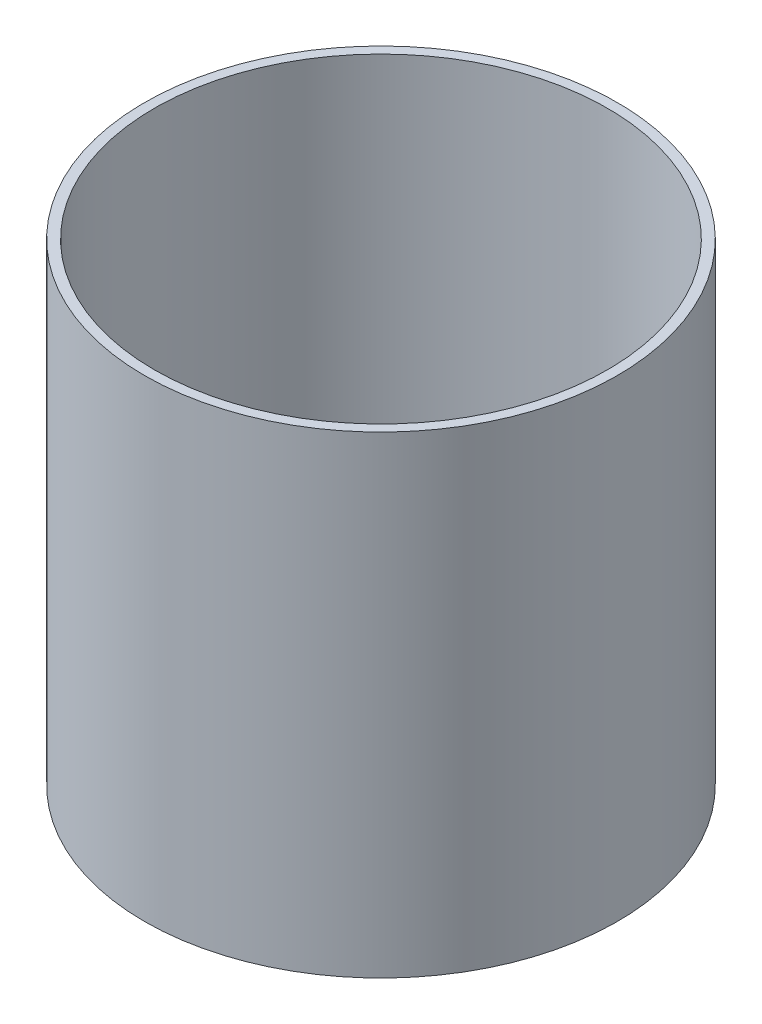
ISO-10303-21;
HEADER;
FILE_DESCRIPTION(('STEP AP214'),'2;1');
FILE_NAME('part.step','',(''),(''),'','','');
FILE_SCHEMA(('AUTOMOTIVE_DESIGN { 1 0 10303 214 1 1 1 1 }'));
ENDSEC;
DATA;
#1=APPLICATION_CONTEXT('core data for automotive mechanical design processes');
#2=APPLICATION_PROTOCOL_DEFINITION('international standard','automotive_design',2000,#1);
#3=PRODUCT_CONTEXT('',#1,'mechanical');
#4=PRODUCT('Part','Part','',(#3));
#5=PRODUCT_RELATED_PRODUCT_CATEGORY('part','',(#4));
#6=PRODUCT_DEFINITION_FORMATION('','',#4);
#7=PRODUCT_DEFINITION_CONTEXT('part definition',#1,'design');
#8=PRODUCT_DEFINITION('design','',#6,#7);
#9=PRODUCT_DEFINITION_SHAPE('','',#8);
#10=(LENGTH_UNIT() NAMED_UNIT(*) SI_UNIT(.MILLI.,.METRE.));
#11=(NAMED_UNIT(*) PLANE_ANGLE_UNIT() SI_UNIT($,.RADIAN.));
#12=(NAMED_UNIT(*) SI_UNIT($,.STERADIAN.) SOLID_ANGLE_UNIT());
#13=UNCERTAINTY_MEASURE_WITH_UNIT(LENGTH_MEASURE(1.E-05),#10,'distance_accuracy_value','');
#14=(GEOMETRIC_REPRESENTATION_CONTEXT(3) GLOBAL_UNCERTAINTY_ASSIGNED_CONTEXT((#13)) GLOBAL_UNIT_ASSIGNED_CONTEXT((#10,
#11,#12)) REPRESENTATION_CONTEXT('',''));
#15=CARTESIAN_POINT('',(0.,0.,0.));
#16=DIRECTION('',(0.,0.,1.));
#17=DIRECTION('',(1.,0.,0.));
#18=AXIS2_PLACEMENT_3D('',#15,#16,#17);
#19=CARTESIAN_POINT('',(0.,304.8,0.));
#20=DIRECTION('',(0.,1.,0.));
#21=DIRECTION('',(0.,0.,1.));
#22=AXIS2_PLACEMENT_3D('',#19,#20,#21);
#23=PLANE('',#22);
#24=CARTESIAN_POINT('',(0.,304.8,0.));
#25=DIRECTION('',(0.,1.,0.));
#26=DIRECTION('',(0.,0.,1.));
#27=AXIS2_PLACEMENT_3D('',#24,#25,#26);
#28=CIRCLE('',#27,152.4);
#29=CARTESIAN_POINT('',(0.,304.8,152.4));
#30=VERTEX_POINT('',#29);
#31=EDGE_CURVE('E10',#30,#30,#28,.T.);
#32=ORIENTED_EDGE('',*,*,#31,.T.);
#33=EDGE_LOOP('',(#32));
#34=FACE_BOUND('',#33,.T.);
#35=CARTESIAN_POINT('',(0.,304.8,0.));
#36=DIRECTION('',(0.,1.,0.));
#37=DIRECTION('',(0.,0.,1.));
#38=AXIS2_PLACEMENT_3D('',#35,#36,#37);
#39=CIRCLE('',#38,146.05);
#40=CARTESIAN_POINT('',(0.,304.8,146.05));
#41=VERTEX_POINT('',#40);
#42=EDGE_CURVE('E42',#41,#41,#39,.T.);
#43=ORIENTED_EDGE('',*,*,#42,.F.);
#44=EDGE_LOOP('',(#43));
#45=FACE_BOUND('',#44,.T.);
#46=ADVANCED_FACE('F31',(#34,#45),#23,.T.);
#47=CARTESIAN_POINT('',(0.,0.,0.));
#48=DIRECTION('',(0.,1.,0.));
#49=DIRECTION('',(0.,0.,1.));
#50=AXIS2_PLACEMENT_3D('',#47,#48,#49);
#51=PLANE('',#50);
#52=CARTESIAN_POINT('',(0.,0.,0.));
#53=DIRECTION('',(0.,1.,0.));
#54=DIRECTION('',(0.,0.,1.));
#55=AXIS2_PLACEMENT_3D('',#52,#53,#54);
#56=CIRCLE('',#55,152.4);
#57=CARTESIAN_POINT('',(0.,0.,152.4));
#58=VERTEX_POINT('',#57);
#59=EDGE_CURVE('E35',#58,#58,#56,.T.);
#60=ORIENTED_EDGE('',*,*,#59,.F.);
#61=EDGE_LOOP('',(#60));
#62=FACE_BOUND('',#61,.T.);
#63=CARTESIAN_POINT('',(0.,0.,0.));
#64=DIRECTION('',(0.,1.,0.));
#65=DIRECTION('',(0.,0.,1.));
#66=AXIS2_PLACEMENT_3D('',#63,#64,#65);
#67=CIRCLE('',#66,146.05);
#68=CARTESIAN_POINT('',(0.,0.,146.05));
#69=VERTEX_POINT('',#68);
#70=EDGE_CURVE('E44',#69,#69,#67,.T.);
#71=ORIENTED_EDGE('',*,*,#70,.T.);
#72=EDGE_LOOP('',(#71));
#73=FACE_BOUND('',#72,.T.);
#74=ADVANCED_FACE('F54',(#62,#73),#51,.F.);
#75=CARTESIAN_POINT('',(0.,304.8,0.));
#76=DIRECTION('',(0.,-1.,0.));
#77=DIRECTION('',(0.,0.,-1.));
#78=AXIS2_PLACEMENT_3D('',#75,#76,#77);
#79=CYLINDRICAL_SURFACE('',#78,152.4);
#80=ORIENTED_EDGE('',*,*,#31,.F.);
#81=EDGE_LOOP('',(#80));
#82=FACE_BOUND('',#81,.T.);
#83=ORIENTED_EDGE('',*,*,#59,.T.);
#84=EDGE_LOOP('',(#83));
#85=FACE_BOUND('',#84,.T.);
#86=ADVANCED_FACE('F33',(#82,#85),#79,.T.);
#87=CARTESIAN_POINT('',(0.,304.8,0.));
#88=DIRECTION('',(0.,-1.,0.));
#89=DIRECTION('',(0.,0.,-1.));
#90=AXIS2_PLACEMENT_3D('',#87,#88,#89);
#91=CYLINDRICAL_SURFACE('',#90,146.05);
#92=ORIENTED_EDGE('',*,*,#42,.T.);
#93=EDGE_LOOP('',(#92));
#94=FACE_BOUND('',#93,.T.);
#95=ORIENTED_EDGE('',*,*,#70,.F.);
#96=EDGE_LOOP('',(#95));
#97=FACE_BOUND('',#96,.T.);
#98=ADVANCED_FACE('F50',(#94,#97),#91,.F.);
#99=CLOSED_SHELL('',(#46,#74,#86,#98));
#100=MANIFOLD_SOLID_BREP('B2',#99);
#101=ADVANCED_BREP_SHAPE_REPRESENTATION('',(#18,#100),#14);
#102=SHAPE_DEFINITION_REPRESENTATION(#9,#101);
ENDSEC;
END-ISO-10303-21;
